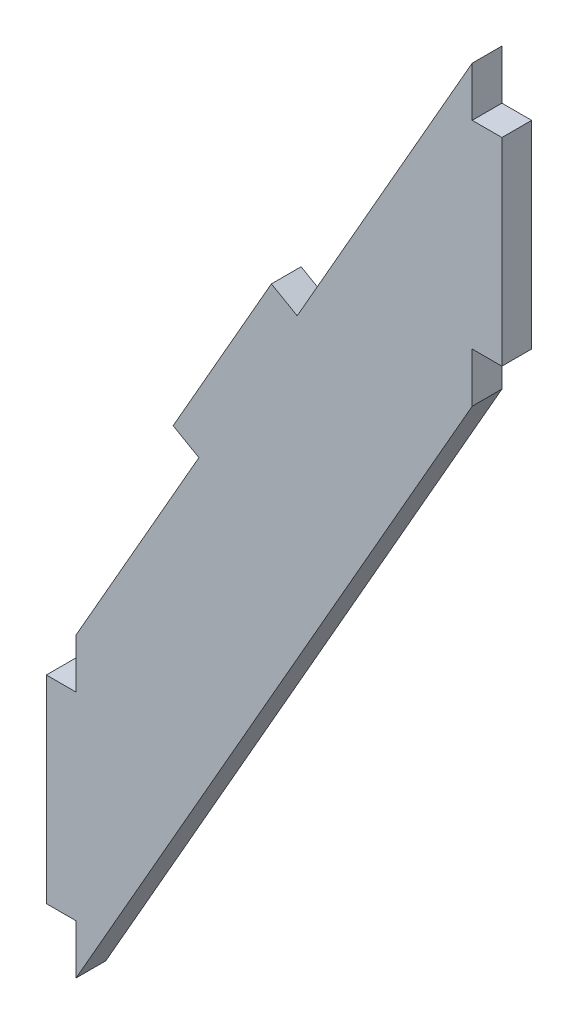
ISO-10303-21;
HEADER;
FILE_DESCRIPTION(('STEP AP214'),'2;1');
FILE_NAME('part.step','',(''),(''),'','','');
FILE_SCHEMA(('AUTOMOTIVE_DESIGN { 1 0 10303 214 1 1 1 1 }'));
ENDSEC;
DATA;
#1=APPLICATION_CONTEXT('core data for automotive mechanical design processes');
#2=APPLICATION_PROTOCOL_DEFINITION('international standard','automotive_design',2000,#1);
#3=PRODUCT_CONTEXT('',#1,'mechanical');
#4=PRODUCT('Part','Part','',(#3));
#5=PRODUCT_RELATED_PRODUCT_CATEGORY('part','',(#4));
#6=PRODUCT_DEFINITION_FORMATION('','',#4);
#7=PRODUCT_DEFINITION_CONTEXT('part definition',#1,'design');
#8=PRODUCT_DEFINITION('design','',#6,#7);
#9=PRODUCT_DEFINITION_SHAPE('','',#8);
#10=(LENGTH_UNIT() NAMED_UNIT(*) SI_UNIT(.MILLI.,.METRE.));
#11=(NAMED_UNIT(*) PLANE_ANGLE_UNIT() SI_UNIT($,.RADIAN.));
#12=(NAMED_UNIT(*) SI_UNIT($,.STERADIAN.) SOLID_ANGLE_UNIT());
#13=UNCERTAINTY_MEASURE_WITH_UNIT(LENGTH_MEASURE(1.E-05),#10,'distance_accuracy_value','');
#14=(GEOMETRIC_REPRESENTATION_CONTEXT(3) GLOBAL_UNCERTAINTY_ASSIGNED_CONTEXT((#13)) GLOBAL_UNIT_ASSIGNED_CONTEXT((#10,
#11,#12)) REPRESENTATION_CONTEXT('',''));
#15=CARTESIAN_POINT('',(0.,0.,0.));
#16=DIRECTION('',(0.,0.,1.));
#17=DIRECTION('',(1.,0.,0.));
#18=AXIS2_PLACEMENT_3D('',#15,#16,#17);
#19=CARTESIAN_POINT('',(-0.01,0.,-0.01));
#20=DIRECTION('',(0.,-1.,0.));
#21=DIRECTION('',(1.,0.,0.));
#22=AXIS2_PLACEMENT_3D('',#19,#20,#21);
#23=PLANE('',#22);
#24=DIRECTION('',(1.,0.,0.));
#25=VECTOR('',#24,1.);
#26=CARTESIAN_POINT('',(23.0000000000001,0.,3.));
#27=LINE('',#26,#25);
#28=CARTESIAN_POINT('',(0.,0.,3.));
#29=VERTEX_POINT('',#28);
#30=CARTESIAN_POINT('',(3.,0.,3.));
#31=VERTEX_POINT('',#30);
#32=EDGE_CURVE('E156',#29,#31,#27,.T.);
#33=ORIENTED_EDGE('',*,*,#32,.F.);
#34=DIRECTION('',(0.,0.,1.));
#35=VECTOR('',#34,1.);
#36=CARTESIAN_POINT('',(0.,0.,1.5));
#37=LINE('',#36,#35);
#38=CARTESIAN_POINT('',(0.,0.,0.));
#39=VERTEX_POINT('',#38);
#40=EDGE_CURVE('E283',#39,#29,#37,.T.);
#41=ORIENTED_EDGE('',*,*,#40,.F.);
#42=DIRECTION('',(-1.,0.,0.));
#43=VECTOR('',#42,1.);
#44=CARTESIAN_POINT('',(23.0000000000001,0.,0.));
#45=LINE('',#44,#43);
#46=CARTESIAN_POINT('',(3.,0.,0.));
#47=VERTEX_POINT('',#46);
#48=EDGE_CURVE('E176',#47,#39,#45,.T.);
#49=ORIENTED_EDGE('',*,*,#48,.F.);
#50=DIRECTION('',(0.,0.,-1.));
#51=VECTOR('',#50,1.);
#52=CARTESIAN_POINT('',(3.,0.,1.5));
#53=LINE('',#52,#51);
#54=EDGE_CURVE('E276',#31,#47,#53,.T.);
#55=ORIENTED_EDGE('',*,*,#54,.F.);
#56=EDGE_LOOP('',(#33,#41,#49,#55));
#57=FACE_BOUND('',#56,.T.);
#58=ADVANCED_FACE('F16',(#57),#23,.T.);
#59=CARTESIAN_POINT('',(0.,20.01,-0.01));
#60=DIRECTION('',(-1.,0.,0.));
#61=DIRECTION('',(0.,-1.,0.));
#62=AXIS2_PLACEMENT_3D('',#59,#60,#61);
#63=PLANE('',#62);
#64=DIRECTION('',(0.,-1.,0.));
#65=VECTOR('',#64,1.);
#66=CARTESIAN_POINT('',(0.,45.,3.));
#67=LINE('',#66,#65);
#68=CARTESIAN_POINT('',(0.,20.,3.));
#69=VERTEX_POINT('',#68);
#70=EDGE_CURVE('E180',#69,#29,#67,.T.);
#71=ORIENTED_EDGE('',*,*,#70,.F.);
#72=DIRECTION('',(0.,0.,1.));
#73=VECTOR('',#72,1.);
#74=CARTESIAN_POINT('',(0.,20.,1.5));
#75=LINE('',#74,#73);
#76=CARTESIAN_POINT('',(0.,20.,0.));
#77=VERTEX_POINT('',#76);
#78=EDGE_CURVE('E173',#77,#69,#75,.T.);
#79=ORIENTED_EDGE('',*,*,#78,.F.);
#80=DIRECTION('',(0.,1.,0.));
#81=VECTOR('',#80,1.);
#82=CARTESIAN_POINT('',(0.,45.,0.));
#83=LINE('',#82,#81);
#84=EDGE_CURVE('E260',#39,#77,#83,.T.);
#85=ORIENTED_EDGE('',*,*,#84,.F.);
#86=ORIENTED_EDGE('',*,*,#40,.T.);
#87=EDGE_LOOP('',(#71,#79,#85,#86));
#88=FACE_BOUND('',#87,.T.);
#89=ADVANCED_FACE('F288',(#88),#63,.T.);
#90=CARTESIAN_POINT('',(3.01,20.,-0.01));
#91=DIRECTION('',(0.,1.,0.));
#92=DIRECTION('',(-1.,0.,0.));
#93=AXIS2_PLACEMENT_3D('',#90,#91,#92);
#94=PLANE('',#93);
#95=DIRECTION('',(-1.,0.,0.));
#96=VECTOR('',#95,1.);
#97=CARTESIAN_POINT('',(23.0000000000001,20.,3.));
#98=LINE('',#97,#96);
#99=CARTESIAN_POINT('',(3.,20.,3.));
#100=VERTEX_POINT('',#99);
#101=EDGE_CURVE('E267',#100,#69,#98,.T.);
#102=ORIENTED_EDGE('',*,*,#101,.F.);
#103=DIRECTION('',(0.,0.,1.));
#104=VECTOR('',#103,1.);
#105=CARTESIAN_POINT('',(3.,20.,1.5));
#106=LINE('',#105,#104);
#107=CARTESIAN_POINT('',(3.,20.,0.));
#108=VERTEX_POINT('',#107);
#109=EDGE_CURVE('E158',#108,#100,#106,.T.);
#110=ORIENTED_EDGE('',*,*,#109,.F.);
#111=DIRECTION('',(1.,0.,0.));
#112=VECTOR('',#111,1.);
#113=CARTESIAN_POINT('',(23.0000000000001,20.,0.));
#114=LINE('',#113,#112);
#115=EDGE_CURVE('E257',#77,#108,#114,.T.);
#116=ORIENTED_EDGE('',*,*,#115,.F.);
#117=ORIENTED_EDGE('',*,*,#78,.T.);
#118=EDGE_LOOP('',(#102,#110,#116,#117));
#119=FACE_BOUND('',#118,.T.);
#120=ADVANCED_FACE('F292',(#119),#94,.T.);
#121=CARTESIAN_POINT('',(22.7128403682629,65.5643196000547,3.01));
#122=DIRECTION('',(0.49613893835682,0.868243142124467,0.));
#123=DIRECTION('',(0.868243142124467,-0.49613893835682,0.));
#124=AXIS2_PLACEMENT_3D('',#121,#122,#123);
#125=PLANE('',#124);
#126=DIRECTION('',(0.868243142124465,-0.496138938356823,0.));
#127=VECTOR('',#126,1.);
#128=CARTESIAN_POINT('',(22.7215227996841,65.5593582106712,0.));
#129=LINE('',#128,#127);
#130=CARTESIAN_POINT('',(22.7215227996841,65.5593582106712,0.));
#131=VERTEX_POINT('',#130);
#132=CARTESIAN_POINT('',(25.3262522260575,64.0709413956007,0.));
#133=VERTEX_POINT('',#132);
#134=EDGE_CURVE('E201',#131,#133,#129,.T.);
#135=ORIENTED_EDGE('',*,*,#134,.F.);
#136=DIRECTION('',(0.,0.,-1.));
#137=VECTOR('',#136,1.);
#138=CARTESIAN_POINT('',(22.7215227996841,65.5593582106712,1.5));
#139=LINE('',#138,#137);
#140=CARTESIAN_POINT('',(22.7215227996841,65.5593582106712,3.));
#141=VERTEX_POINT('',#140);
#142=EDGE_CURVE('E174',#141,#131,#139,.T.);
#143=ORIENTED_EDGE('',*,*,#142,.F.);
#144=DIRECTION('',(-0.868243142124465,0.496138938356823,0.));
#145=VECTOR('',#144,1.);
#146=CARTESIAN_POINT('',(25.3262522260575,64.0709413956007,3.));
#147=LINE('',#146,#145);
#148=CARTESIAN_POINT('',(25.3262522260575,64.0709413956007,3.));
#149=VERTEX_POINT('',#148);
#150=EDGE_CURVE('E208',#149,#141,#147,.T.);
#151=ORIENTED_EDGE('',*,*,#150,.F.);
#152=DIRECTION('',(0.,0.,1.));
#153=VECTOR('',#152,1.);
#154=CARTESIAN_POINT('',(25.3262522260576,64.0709413956007,1.5));
#155=LINE('',#154,#153);
#156=EDGE_CURVE('E166',#133,#149,#155,.T.);
#157=ORIENTED_EDGE('',*,*,#156,.F.);
#158=EDGE_LOOP('',(#135,#143,#151,#157));
#159=FACE_BOUND('',#158,.T.);
#160=ADVANCED_FACE('F222',(#159),#125,.T.);
#161=CARTESIAN_POINT('',(43.0049613893836,95.0086824314212,-0.01));
#162=DIRECTION('',(-0.868243142124459,0.496138938356834,0.));
#163=DIRECTION('',(-0.496138938356834,-0.868243142124459,0.));
#164=AXIS2_PLACEMENT_3D('',#161,#162,#163);
#165=PLANE('',#164);
#166=DIRECTION('',(0.,0.,1.));
#167=VECTOR('',#166,1.);
#168=CARTESIAN_POINT('',(43.,95.,1.5));
#169=LINE('',#168,#167);
#170=CARTESIAN_POINT('',(43.,95.,0.));
#171=VERTEX_POINT('',#170);
#172=CARTESIAN_POINT('',(43.,95.,3.));
#173=VERTEX_POINT('',#172);
#174=EDGE_CURVE('E163',#171,#173,#169,.T.);
#175=ORIENTED_EDGE('',*,*,#174,.F.);
#176=DIRECTION('',(0.496138938356835,0.868243142124459,0.));
#177=VECTOR('',#176,1.);
#178=CARTESIAN_POINT('',(25.3262522260575,64.0709413956007,0.));
#179=LINE('',#178,#177);
#180=EDGE_CURVE('E197',#133,#171,#179,.T.);
#181=ORIENTED_EDGE('',*,*,#180,.F.);
#182=ORIENTED_EDGE('',*,*,#156,.T.);
#183=DIRECTION('',(-0.496138938356835,-0.868243142124459,0.));
#184=VECTOR('',#183,1.);
#185=CARTESIAN_POINT('',(43.,95.,3.));
#186=LINE('',#185,#184);
#187=EDGE_CURVE('E170',#173,#149,#186,.T.);
#188=ORIENTED_EDGE('',*,*,#187,.F.);
#189=EDGE_LOOP('',(#175,#181,#182,#188));
#190=FACE_BOUND('',#189,.T.);
#191=ADVANCED_FACE('F217',(#190),#165,.T.);
#192=CARTESIAN_POINT('',(43.,89.99,-0.01));
#193=DIRECTION('',(1.,0.,0.));
#194=DIRECTION('',(0.,1.,0.));
#195=AXIS2_PLACEMENT_3D('',#192,#193,#194);
#196=PLANE('',#195);
#197=DIRECTION('',(0.,1.,0.));
#198=VECTOR('',#197,1.);
#199=CARTESIAN_POINT('',(43.,45.,3.));
#200=LINE('',#199,#198);
#201=CARTESIAN_POINT('',(43.,90.,3.));
#202=VERTEX_POINT('',#201);
#203=EDGE_CURVE('E167',#202,#173,#200,.T.);
#204=ORIENTED_EDGE('',*,*,#203,.F.);
#205=DIRECTION('',(0.,0.,1.));
#206=VECTOR('',#205,1.);
#207=CARTESIAN_POINT('',(43.,90.,1.5));
#208=LINE('',#207,#206);
#209=CARTESIAN_POINT('',(43.,90.,0.));
#210=VERTEX_POINT('',#209);
#211=EDGE_CURVE('E165',#210,#202,#208,.T.);
#212=ORIENTED_EDGE('',*,*,#211,.F.);
#213=DIRECTION('',(0.,-1.,0.));
#214=VECTOR('',#213,1.);
#215=CARTESIAN_POINT('',(43.,45.,0.));
#216=LINE('',#215,#214);
#217=EDGE_CURVE('E193',#171,#210,#216,.T.);
#218=ORIENTED_EDGE('',*,*,#217,.F.);
#219=ORIENTED_EDGE('',*,*,#174,.T.);
#220=EDGE_LOOP('',(#204,#212,#218,#219));
#221=FACE_BOUND('',#220,.T.);
#222=ADVANCED_FACE('F244',(#221),#196,.T.);
#223=CARTESIAN_POINT('',(46.0100000000002,90.,-0.01));
#224=DIRECTION('',(0.,1.,0.));
#225=DIRECTION('',(-1.,0.,0.));
#226=AXIS2_PLACEMENT_3D('',#223,#224,#225);
#227=PLANE('',#226);
#228=DIRECTION('',(-1.,0.,0.));
#229=VECTOR('',#228,1.);
#230=CARTESIAN_POINT('',(23.0000000000001,90.,3.));
#231=LINE('',#230,#229);
#232=CARTESIAN_POINT('',(46.0000000000002,90.,3.));
#233=VERTEX_POINT('',#232);
#234=EDGE_CURVE('E171',#233,#202,#231,.T.);
#235=ORIENTED_EDGE('',*,*,#234,.F.);
#236=DIRECTION('',(0.,0.,1.));
#237=VECTOR('',#236,1.);
#238=CARTESIAN_POINT('',(46.0000000000002,90.,1.5));
#239=LINE('',#238,#237);
#240=CARTESIAN_POINT('',(46.0000000000002,90.,0.));
#241=VERTEX_POINT('',#240);
#242=EDGE_CURVE('E247',#241,#233,#239,.T.);
#243=ORIENTED_EDGE('',*,*,#242,.F.);
#244=DIRECTION('',(1.,0.,0.));
#245=VECTOR('',#244,1.);
#246=CARTESIAN_POINT('',(23.0000000000001,90.,0.));
#247=LINE('',#246,#245);
#248=EDGE_CURVE('E196',#210,#241,#247,.T.);
#249=ORIENTED_EDGE('',*,*,#248,.F.);
#250=ORIENTED_EDGE('',*,*,#211,.T.);
#251=EDGE_LOOP('',(#235,#243,#249,#250));
#252=FACE_BOUND('',#251,.T.);
#253=ADVANCED_FACE('F249',(#252),#227,.T.);
#254=CARTESIAN_POINT('',(46.0000000000002,69.99,-0.01));
#255=DIRECTION('',(1.,0.,0.));
#256=DIRECTION('',(0.,1.,0.));
#257=AXIS2_PLACEMENT_3D('',#254,#255,#256);
#258=PLANE('',#257);
#259=DIRECTION('',(0.,1.,0.));
#260=VECTOR('',#259,1.);
#261=CARTESIAN_POINT('',(46.0000000000002,45.,3.));
#262=LINE('',#261,#260);
#263=CARTESIAN_POINT('',(46.0000000000002,70.,3.));
#264=VERTEX_POINT('',#263);
#265=EDGE_CURVE('E271',#264,#233,#262,.T.);
#266=ORIENTED_EDGE('',*,*,#265,.F.);
#267=DIRECTION('',(0.,0.,1.));
#268=VECTOR('',#267,1.);
#269=CARTESIAN_POINT('',(46.0000000000002,70.,1.5));
#270=LINE('',#269,#268);
#271=CARTESIAN_POINT('',(46.0000000000002,70.,0.));
#272=VERTEX_POINT('',#271);
#273=EDGE_CURVE('E280',#272,#264,#270,.T.);
#274=ORIENTED_EDGE('',*,*,#273,.F.);
#275=DIRECTION('',(0.,-1.,0.));
#276=VECTOR('',#275,1.);
#277=CARTESIAN_POINT('',(46.0000000000002,45.,0.));
#278=LINE('',#277,#276);
#279=EDGE_CURVE('E251',#241,#272,#278,.T.);
#280=ORIENTED_EDGE('',*,*,#279,.F.);
#281=ORIENTED_EDGE('',*,*,#242,.T.);
#282=EDGE_LOOP('',(#266,#274,#280,#281));
#283=FACE_BOUND('',#282,.T.);
#284=ADVANCED_FACE('F304',(#283),#258,.T.);
#285=CARTESIAN_POINT('',(42.99,70.,-0.01));
#286=DIRECTION('',(0.,-1.,0.));
#287=DIRECTION('',(1.,0.,0.));
#288=AXIS2_PLACEMENT_3D('',#285,#286,#287);
#289=PLANE('',#288);
#290=DIRECTION('',(1.,0.,0.));
#291=VECTOR('',#290,1.);
#292=CARTESIAN_POINT('',(23.0000000000001,70.,3.));
#293=LINE('',#292,#291);
#294=CARTESIAN_POINT('',(43.,70.,3.));
#295=VERTEX_POINT('',#294);
#296=EDGE_CURVE('E150',#295,#264,#293,.T.);
#297=ORIENTED_EDGE('',*,*,#296,.F.);
#298=DIRECTION('',(0.,0.,1.));
#299=VECTOR('',#298,1.);
#300=CARTESIAN_POINT('',(43.,70.,1.5));
#301=LINE('',#300,#299);
#302=CARTESIAN_POINT('',(43.,70.,0.));
#303=VERTEX_POINT('',#302);
#304=EDGE_CURVE('E142',#303,#295,#301,.T.);
#305=ORIENTED_EDGE('',*,*,#304,.F.);
#306=DIRECTION('',(-1.,0.,0.));
#307=VECTOR('',#306,1.);
#308=CARTESIAN_POINT('',(23.0000000000001,70.,0.));
#309=LINE('',#308,#307);
#310=EDGE_CURVE('E183',#272,#303,#309,.T.);
#311=ORIENTED_EDGE('',*,*,#310,.F.);
#312=ORIENTED_EDGE('',*,*,#273,.T.);
#313=EDGE_LOOP('',(#297,#305,#311,#312));
#314=FACE_BOUND('',#313,.T.);
#315=ADVANCED_FACE('F301',(#314),#289,.T.);
#316=CARTESIAN_POINT('',(43.,64.9900000000001,-0.01));
#317=DIRECTION('',(1.,0.,0.));
#318=DIRECTION('',(0.,1.,0.));
#319=AXIS2_PLACEMENT_3D('',#316,#317,#318);
#320=PLANE('',#319);
#321=DIRECTION('',(0.,1.,0.));
#322=VECTOR('',#321,1.);
#323=CARTESIAN_POINT('',(43.,45.,3.));
#324=LINE('',#323,#322);
#325=CARTESIAN_POINT('',(43.,65.0000000000001,3.));
#326=VERTEX_POINT('',#325);
#327=EDGE_CURVE('E145',#326,#295,#324,.T.);
#328=ORIENTED_EDGE('',*,*,#327,.F.);
#329=DIRECTION('',(0.,0.,1.));
#330=VECTOR('',#329,1.);
#331=CARTESIAN_POINT('',(43.,65.0000000000001,1.5));
#332=LINE('',#331,#330);
#333=CARTESIAN_POINT('',(43.,65.0000000000001,0.));
#334=VERTEX_POINT('',#333);
#335=EDGE_CURVE('E132',#334,#326,#332,.T.);
#336=ORIENTED_EDGE('',*,*,#335,.F.);
#337=DIRECTION('',(0.,-1.,0.));
#338=VECTOR('',#337,1.);
#339=CARTESIAN_POINT('',(43.,45.,0.));
#340=LINE('',#339,#338);
#341=EDGE_CURVE('E181',#303,#334,#340,.T.);
#342=ORIENTED_EDGE('',*,*,#341,.F.);
#343=ORIENTED_EDGE('',*,*,#304,.T.);
#344=EDGE_LOOP('',(#328,#336,#342,#343));
#345=FACE_BOUND('',#344,.T.);
#346=ADVANCED_FACE('F146',(#345),#320,.T.);
#347=CARTESIAN_POINT('',(2.99503861061643,-5.00868243142124,-0.01));
#348=DIRECTION('',(0.868243142124459,-0.496138938356834,0.));
#349=DIRECTION('',(0.496138938356834,0.868243142124459,0.));
#350=AXIS2_PLACEMENT_3D('',#347,#348,#349);
#351=PLANE('',#350);
#352=DIRECTION('',(0.496138938356833,0.868243142124459,0.));
#353=VECTOR('',#352,1.);
#354=CARTESIAN_POINT('',(3.,-5.,3.));
#355=LINE('',#354,#353);
#356=CARTESIAN_POINT('',(3.,-5.,3.));
#357=VERTEX_POINT('',#356);
#358=EDGE_CURVE('E20',#357,#326,#355,.T.);
#359=ORIENTED_EDGE('',*,*,#358,.F.);
#360=DIRECTION('',(0.,0.,1.));
#361=VECTOR('',#360,1.);
#362=CARTESIAN_POINT('',(3.,-5.,1.5));
#363=LINE('',#362,#361);
#364=CARTESIAN_POINT('',(3.00000000000001,-4.99999999999998,0.));
#365=VERTEX_POINT('',#364);
#366=EDGE_CURVE('E127',#365,#357,#363,.T.);
#367=ORIENTED_EDGE('',*,*,#366,.F.);
#368=DIRECTION('',(-0.496138938356833,-0.868243142124459,0.));
#369=VECTOR('',#368,1.);
#370=CARTESIAN_POINT('',(43.,65.0000000000001,0.));
#371=LINE('',#370,#369);
#372=EDGE_CURVE('E138',#334,#365,#371,.T.);
#373=ORIENTED_EDGE('',*,*,#372,.F.);
#374=ORIENTED_EDGE('',*,*,#335,.T.);
#375=EDGE_LOOP('',(#359,#367,#373,#374));
#376=FACE_BOUND('',#375,.T.);
#377=ADVANCED_FACE('F134',(#376),#351,.T.);
#378=CARTESIAN_POINT('',(3.,0.0100000000000002,-0.01));
#379=DIRECTION('',(-1.,0.,0.));
#380=DIRECTION('',(0.,-1.,0.));
#381=AXIS2_PLACEMENT_3D('',#378,#379,#380);
#382=PLANE('',#381);
#383=DIRECTION('',(0.,-1.,0.));
#384=VECTOR('',#383,1.);
#385=CARTESIAN_POINT('',(3.,45.,3.));
#386=LINE('',#385,#384);
#387=EDGE_CURVE('E155',#31,#357,#386,.T.);
#388=ORIENTED_EDGE('',*,*,#387,.F.);
#389=ORIENTED_EDGE('',*,*,#54,.T.);
#390=DIRECTION('',(0.,1.,0.));
#391=VECTOR('',#390,1.);
#392=CARTESIAN_POINT('',(3.,45.,0.));
#393=LINE('',#392,#391);
#394=EDGE_CURVE('E184',#365,#47,#393,.T.);
#395=ORIENTED_EDGE('',*,*,#394,.F.);
#396=ORIENTED_EDGE('',*,*,#366,.T.);
#397=EDGE_LOOP('',(#388,#389,#395,#396));
#398=FACE_BOUND('',#397,.T.);
#399=ADVANCED_FACE('F295',(#398),#382,.T.);
#400=CARTESIAN_POINT('',(3.,25.01,-0.01));
#401=DIRECTION('',(-1.,0.,0.));
#402=DIRECTION('',(0.,-1.,0.));
#403=AXIS2_PLACEMENT_3D('',#400,#401,#402);
#404=PLANE('',#403);
#405=DIRECTION('',(0.,-1.,0.));
#406=VECTOR('',#405,1.);
#407=CARTESIAN_POINT('',(3.,45.,3.));
#408=LINE('',#407,#406);
#409=CARTESIAN_POINT('',(2.99999999999999,25.,3.));
#410=VERTEX_POINT('',#409);
#411=EDGE_CURVE('E209',#410,#100,#408,.T.);
#412=ORIENTED_EDGE('',*,*,#411,.F.);
#413=DIRECTION('',(0.,0.,1.));
#414=VECTOR('',#413,1.);
#415=CARTESIAN_POINT('',(2.99999999999998,25.,1.5));
#416=LINE('',#415,#414);
#417=CARTESIAN_POINT('',(3.,25.,0.));
#418=VERTEX_POINT('',#417);
#419=EDGE_CURVE('E237',#418,#410,#416,.T.);
#420=ORIENTED_EDGE('',*,*,#419,.F.);
#421=DIRECTION('',(0.,1.,0.));
#422=VECTOR('',#421,1.);
#423=CARTESIAN_POINT('',(3.,45.,0.));
#424=LINE('',#423,#422);
#425=EDGE_CURVE('E207',#108,#418,#424,.T.);
#426=ORIENTED_EDGE('',*,*,#425,.F.);
#427=ORIENTED_EDGE('',*,*,#109,.T.);
#428=EDGE_LOOP('',(#412,#420,#426,#427));
#429=FACE_BOUND('',#428,.T.);
#430=ADVANCED_FACE('F327',(#429),#404,.T.);
#431=CARTESIAN_POINT('',(-0.00999999999999891,-5.01,3.));
#432=DIRECTION('',(0.,0.,1.));
#433=DIRECTION('',(1.,0.,0.));
#434=AXIS2_PLACEMENT_3D('',#431,#432,#433);
#435=PLANE('',#434);
#436=ORIENTED_EDGE('',*,*,#101,.T.);
#437=ORIENTED_EDGE('',*,*,#70,.T.);
#438=ORIENTED_EDGE('',*,*,#32,.T.);
#439=ORIENTED_EDGE('',*,*,#387,.T.);
#440=ORIENTED_EDGE('',*,*,#358,.T.);
#441=ORIENTED_EDGE('',*,*,#327,.T.);
#442=ORIENTED_EDGE('',*,*,#296,.T.);
#443=ORIENTED_EDGE('',*,*,#265,.T.);
#444=ORIENTED_EDGE('',*,*,#234,.T.);
#445=ORIENTED_EDGE('',*,*,#203,.T.);
#446=ORIENTED_EDGE('',*,*,#187,.T.);
#447=ORIENTED_EDGE('',*,*,#150,.T.);
#448=DIRECTION('',(0.496138938356833,0.86824314212446,0.));
#449=VECTOR('',#448,1.);
#450=CARTESIAN_POINT('',(17.7601334161158,56.8769267894266,3.));
#451=LINE('',#450,#449);
#452=CARTESIAN_POINT('',(12.7987440337878,48.1944953703526,3.));
#453=VERTEX_POINT('',#452);
#454=EDGE_CURVE('E177',#453,#141,#451,.T.);
#455=ORIENTED_EDGE('',*,*,#454,.F.);
#456=DIRECTION('',(-0.868243142124467,0.496138938356821,0.));
#457=VECTOR('',#456,1.);
#458=CARTESIAN_POINT('',(14.1011087457341,47.4502869606467,3.));
#459=LINE('',#458,#457);
#460=CARTESIAN_POINT('',(15.4034734567502,46.7060785543518,3.));
#461=VERTEX_POINT('',#460);
#462=EDGE_CURVE('E192',#461,#453,#459,.T.);
#463=ORIENTED_EDGE('',*,*,#462,.F.);
#464=DIRECTION('',(0.496138938356835,0.868243142124459,0.));
#465=VECTOR('',#464,1.);
#466=CARTESIAN_POINT('',(9.20173672946042,35.8530392765558,3.));
#467=LINE('',#466,#465);
#468=EDGE_CURVE('E230',#410,#461,#467,.T.);
#469=ORIENTED_EDGE('',*,*,#468,.F.);
#470=ORIENTED_EDGE('',*,*,#411,.T.);
#471=EDGE_LOOP('',(#436,#437,#438,#439,#440,#441,#442,#443,#444,#445,#446,#447,#455,#463,#469,#470));
#472=FACE_BOUND('',#471,.T.);
#473=ADVANCED_FACE('F153',(#472),#435,.T.);
#474=CARTESIAN_POINT('',(12.7937826431639,48.1858129367607,3.01));
#475=DIRECTION('',(-0.86824314212446,0.496138938356833,0.));
#476=DIRECTION('',(0.496138938356833,0.86824314212446,0.));
#477=AXIS2_PLACEMENT_3D('',#474,#475,#476);
#478=PLANE('',#477);
#479=DIRECTION('',(0.496138938356831,0.868243142124461,0.));
#480=VECTOR('',#479,1.);
#481=CARTESIAN_POINT('',(12.7987440325475,48.194495368182,0.));
#482=LINE('',#481,#480);
#483=CARTESIAN_POINT('',(12.7987440325475,48.1944953681819,0.));
#484=VERTEX_POINT('',#483);
#485=EDGE_CURVE('E204',#484,#131,#482,.T.);
#486=ORIENTED_EDGE('',*,*,#485,.F.);
#487=DIRECTION('',(0.,0.,-1.));
#488=VECTOR('',#487,1.);
#489=CARTESIAN_POINT('',(12.7987440325475,48.1944953681819,1.5));
#490=LINE('',#489,#488);
#491=EDGE_CURVE('E189',#453,#484,#490,.T.);
#492=ORIENTED_EDGE('',*,*,#491,.F.);
#493=ORIENTED_EDGE('',*,*,#454,.T.);
#494=ORIENTED_EDGE('',*,*,#142,.T.);
#495=EDGE_LOOP('',(#486,#492,#493,#494));
#496=FACE_BOUND('',#495,.T.);
#497=ADVANCED_FACE('F225',(#496),#478,.T.);
#498=CARTESIAN_POINT('',(46.0100000000002,-5.01,0.));
#499=DIRECTION('',(0.,0.,-1.));
#500=DIRECTION('',(-1.,0.,0.));
#501=AXIS2_PLACEMENT_3D('',#498,#499,#500);
#502=PLANE('',#501);
#503=ORIENTED_EDGE('',*,*,#372,.T.);
#504=ORIENTED_EDGE('',*,*,#394,.T.);
#505=ORIENTED_EDGE('',*,*,#48,.T.);
#506=ORIENTED_EDGE('',*,*,#84,.T.);
#507=ORIENTED_EDGE('',*,*,#115,.T.);
#508=ORIENTED_EDGE('',*,*,#425,.T.);
#509=DIRECTION('',(-0.496138938356835,-0.868243142124459,0.));
#510=VECTOR('',#509,1.);
#511=CARTESIAN_POINT('',(9.20173672946042,35.8530392765558,0.));
#512=LINE('',#511,#510);
#513=CARTESIAN_POINT('',(15.4034734576805,46.7060785509409,0.));
#514=VERTEX_POINT('',#513);
#515=EDGE_CURVE('E35',#514,#418,#512,.T.);
#516=ORIENTED_EDGE('',*,*,#515,.F.);
#517=DIRECTION('',(0.868243142124468,-0.496138938356819,0.));
#518=VECTOR('',#517,1.);
#519=CARTESIAN_POINT('',(14.1011087457341,47.4502869606467,0.));
#520=LINE('',#519,#518);
#521=EDGE_CURVE('E26',#484,#514,#520,.T.);
#522=ORIENTED_EDGE('',*,*,#521,.F.);
#523=ORIENTED_EDGE('',*,*,#485,.T.);
#524=ORIENTED_EDGE('',*,*,#134,.T.);
#525=ORIENTED_EDGE('',*,*,#180,.T.);
#526=ORIENTED_EDGE('',*,*,#217,.T.);
#527=ORIENTED_EDGE('',*,*,#248,.T.);
#528=ORIENTED_EDGE('',*,*,#279,.T.);
#529=ORIENTED_EDGE('',*,*,#310,.T.);
#530=ORIENTED_EDGE('',*,*,#341,.T.);
#531=EDGE_LOOP('',(#503,#504,#505,#506,#507,#508,#516,#522,#523,#524,#525,#526,#527,#528,#529,#530));
#532=FACE_BOUND('',#531,.T.);
#533=ADVANCED_FACE('F239',(#532),#502,.T.);
#534=CARTESIAN_POINT('',(15.4084348483044,46.7147609845327,-0.01));
#535=DIRECTION('',(-0.868243142124459,0.496138938356835,0.));
#536=DIRECTION('',(-0.496138938356835,-0.868243142124459,0.));
#537=AXIS2_PLACEMENT_3D('',#534,#535,#536);
#538=PLANE('',#537);
#539=ORIENTED_EDGE('',*,*,#419,.T.);
#540=ORIENTED_EDGE('',*,*,#468,.T.);
#541=DIRECTION('',(0.,0.,1.));
#542=VECTOR('',#541,1.);
#543=CARTESIAN_POINT('',(15.4034734589209,46.7060785531115,1.5));
#544=LINE('',#543,#542);
#545=EDGE_CURVE('E11',#514,#461,#544,.T.);
#546=ORIENTED_EDGE('',*,*,#545,.F.);
#547=ORIENTED_EDGE('',*,*,#515,.T.);
#548=EDGE_LOOP('',(#539,#540,#546,#547));
#549=FACE_BOUND('',#548,.T.);
#550=ADVANCED_FACE('F235',(#549),#538,.T.);
#551=CARTESIAN_POINT('',(15.4121558903421,46.7011171637279,3.01));
#552=DIRECTION('',(-0.496138938356819,-0.868243142124468,0.));
#553=DIRECTION('',(-0.868243142124468,0.496138938356819,0.));
#554=AXIS2_PLACEMENT_3D('',#551,#552,#553);
#555=PLANE('',#554);
#556=ORIENTED_EDGE('',*,*,#521,.T.);
#557=ORIENTED_EDGE('',*,*,#545,.T.);
#558=ORIENTED_EDGE('',*,*,#462,.T.);
#559=ORIENTED_EDGE('',*,*,#491,.T.);
#560=EDGE_LOOP('',(#556,#557,#558,#559));
#561=FACE_BOUND('',#560,.T.);
#562=ADVANCED_FACE('F18',(#561),#555,.T.);
#563=CLOSED_SHELL('',(#58,#89,#120,#160,#191,#222,#253,#284,#315,#346,#377,#399,#430,#473,#497,
#533,#550,#562));
#564=MANIFOLD_SOLID_BREP('B1',#563);
#565=ADVANCED_BREP_SHAPE_REPRESENTATION('',(#18,#564),#14);
#566=SHAPE_DEFINITION_REPRESENTATION(#9,#565);
ENDSEC;
END-ISO-10303-21;
